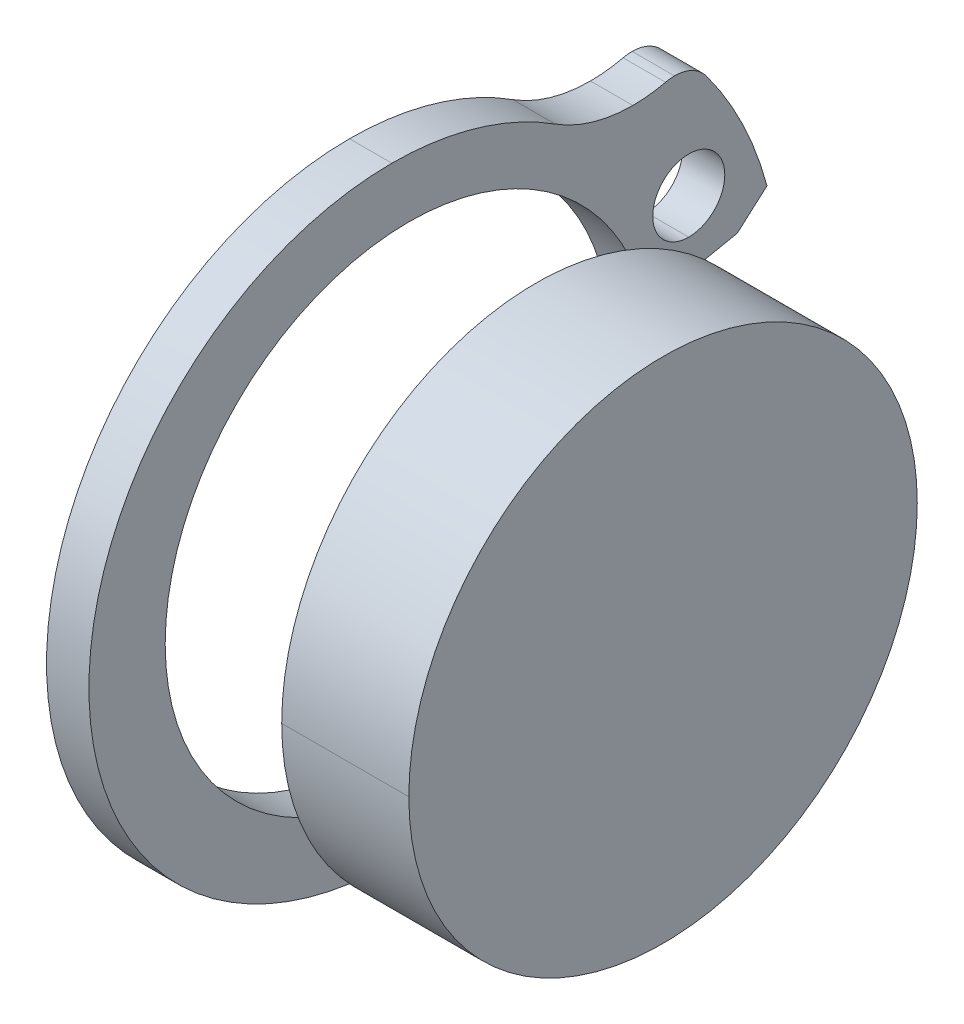
ISO-10303-21;
HEADER;
FILE_DESCRIPTION(('STEP AP214'),'2;1');
FILE_NAME('part.step','',(''),(''),'','','');
FILE_SCHEMA(('AUTOMOTIVE_DESIGN { 1 0 10303 214 1 1 1 1 }'));
ENDSEC;
DATA;
#1=APPLICATION_CONTEXT('core data for automotive mechanical design processes');
#2=APPLICATION_PROTOCOL_DEFINITION('international standard','automotive_design',2000,#1);
#3=PRODUCT_CONTEXT('',#1,'mechanical');
#4=PRODUCT('Part','Part','',(#3));
#5=PRODUCT_RELATED_PRODUCT_CATEGORY('part','',(#4));
#6=PRODUCT_DEFINITION_FORMATION('','',#4);
#7=PRODUCT_DEFINITION_CONTEXT('part definition',#1,'design');
#8=PRODUCT_DEFINITION('design','',#6,#7);
#9=PRODUCT_DEFINITION_SHAPE('','',#8);
#10=(LENGTH_UNIT() NAMED_UNIT(*) SI_UNIT(.MILLI.,.METRE.));
#11=(NAMED_UNIT(*) PLANE_ANGLE_UNIT() SI_UNIT($,.RADIAN.));
#12=(NAMED_UNIT(*) SI_UNIT($,.STERADIAN.) SOLID_ANGLE_UNIT());
#13=UNCERTAINTY_MEASURE_WITH_UNIT(LENGTH_MEASURE(1.E-05),#10,'distance_accuracy_value','');
#14=(GEOMETRIC_REPRESENTATION_CONTEXT(3) GLOBAL_UNCERTAINTY_ASSIGNED_CONTEXT((#13)) GLOBAL_UNIT_ASSIGNED_CONTEXT((#10,
#11,#12)) REPRESENTATION_CONTEXT('',''));
#15=CARTESIAN_POINT('',(0.,0.,0.));
#16=DIRECTION('',(0.,0.,1.));
#17=DIRECTION('',(1.,0.,0.));
#18=AXIS2_PLACEMENT_3D('',#15,#16,#17);
#19=CARTESIAN_POINT('',(-4.,3.03700699861608,-0.21027055578493));
#20=DIRECTION('',(-1.,0.,0.));
#21=DIRECTION('',(0.,0.,1.));
#22=AXIS2_PLACEMENT_3D('',#19,#20,#21);
#23=PLANE('',#22);
#24=CARTESIAN_POINT('',(-4.,2.985,-6.6069868321346));
#25=DIRECTION('',(1.,0.,0.));
#26=DIRECTION('',(0.,1.,0.));
#27=AXIS2_PLACEMENT_3D('',#24,#25,#26);
#28=CIRCLE('',#27,0.85);
#29=CARTESIAN_POINT('',(-4.,2.135,-6.6069868321346));
#30=VERTEX_POINT('',#29);
#31=CARTESIAN_POINT('',(-4.,3.835,-6.6069868321346));
#32=VERTEX_POINT('',#31);
#33=EDGE_CURVE('P0_E337',#30,#32,#28,.T.);
#34=ORIENTED_EDGE('',*,*,#33,.T.);
#35=CARTESIAN_POINT('',(-4.,2.985,-6.6069868321346));
#36=DIRECTION('',(1.,0.,0.));
#37=DIRECTION('',(0.,1.,0.));
#38=AXIS2_PLACEMENT_3D('',#35,#36,#37);
#39=CIRCLE('',#38,0.85);
#40=EDGE_CURVE('P0_E287',#32,#30,#39,.T.);
#41=ORIENTED_EDGE('',*,*,#40,.T.);
#42=EDGE_LOOP('',(#34,#41));
#43=FACE_BOUND('',#42,.T.);
#44=CARTESIAN_POINT('',(-4.,-2.985,-6.6069868321346));
#45=DIRECTION('',(1.,0.,0.));
#46=DIRECTION('',(0.,-1.,0.));
#47=AXIS2_PLACEMENT_3D('',#44,#45,#46);
#48=CIRCLE('',#47,0.85);
#49=CARTESIAN_POINT('',(-4.,-2.135,-6.6069868321346));
#50=VERTEX_POINT('',#49);
#51=CARTESIAN_POINT('',(-4.,-3.835,-6.6069868321346));
#52=VERTEX_POINT('',#51);
#53=EDGE_CURVE('P0_E460',#50,#52,#48,.T.);
#54=ORIENTED_EDGE('',*,*,#53,.T.);
#55=CARTESIAN_POINT('',(-4.,-2.985,-6.6069868321346));
#56=DIRECTION('',(1.,0.,0.));
#57=DIRECTION('',(0.,-1.,0.));
#58=AXIS2_PLACEMENT_3D('',#55,#56,#57);
#59=CIRCLE('',#58,0.85);
#60=EDGE_CURVE('P0_E363',#52,#50,#59,.T.);
#61=ORIENTED_EDGE('',*,*,#60,.T.);
#62=EDGE_LOOP('',(#54,#61));
#63=FACE_BOUND('',#62,.T.);
#64=CARTESIAN_POINT('',(-4.,0.,0.));
#65=DIRECTION('',(1.,0.,0.));
#66=DIRECTION('',(0.,1.,0.));
#67=AXIS2_PLACEMENT_3D('',#64,#65,#66);
#68=CIRCLE('',#67,5.75);
#69=CARTESIAN_POINT('',(-4.,1.21229602418324,-5.6207506927233));
#70=VERTEX_POINT('',#69);
#71=CARTESIAN_POINT('',(-4.,5.75,0.));
#72=VERTEX_POINT('',#71);
#73=EDGE_CURVE('P0_E393',#70,#72,#68,.T.);
#74=ORIENTED_EDGE('',*,*,#73,.T.);
#75=CARTESIAN_POINT('',(-4.,0.,0.));
#76=DIRECTION('',(1.,0.,0.));
#77=DIRECTION('',(0.,1.,0.));
#78=AXIS2_PLACEMENT_3D('',#75,#76,#77);
#79=CIRCLE('',#78,5.75);
#80=CARTESIAN_POINT('',(-4.,-5.75,0.));
#81=VERTEX_POINT('',#80);
#82=EDGE_CURVE('P0_E316',#72,#81,#79,.T.);
#83=ORIENTED_EDGE('',*,*,#82,.T.);
#84=CARTESIAN_POINT('',(-4.,0.,0.));
#85=DIRECTION('',(1.,0.,0.));
#86=DIRECTION('',(0.,1.,0.));
#87=AXIS2_PLACEMENT_3D('',#84,#85,#86);
#88=CIRCLE('',#87,5.75);
#89=CARTESIAN_POINT('',(-4.,-1.21229602418324,-5.6207506927233));
#90=VERTEX_POINT('',#89);
#91=EDGE_CURVE('P0_E310',#81,#90,#88,.T.);
#92=ORIENTED_EDGE('',*,*,#91,.T.);
#93=DIRECTION('',(0.,-0.197391304347826,-0.98032477932972));
#94=VECTOR('',#93,1.);
#95=CARTESIAN_POINT('',(-4.,0.,0.4));
#96=LINE('',#95,#94);
#97=CARTESIAN_POINT('',(-4.,-1.64102669274027,-7.75));
#98=VERTEX_POINT('',#97);
#99=EDGE_CURVE('P0_E269',#90,#98,#96,.T.);
#100=ORIENTED_EDGE('',*,*,#99,.T.);
#101=DIRECTION('',(0.,-0.661108273716222,-0.750290510684999));
#102=VECTOR('',#101,1.);
#103=CARTESIAN_POINT('',(-4.,-1.64102669274027,-7.75));
#104=LINE('',#103,#102);
#105=CARTESIAN_POINT('',(-4.,-2.26044812956455,-8.45298019952419));
#106=VERTEX_POINT('',#105);
#107=EDGE_CURVE('P0_E427',#98,#106,#104,.T.);
#108=ORIENTED_EDGE('',*,*,#107,.T.);
#109=CARTESIAN_POINT('',(-4.,0.,0.));
#110=DIRECTION('',(1.,0.,0.));
#111=DIRECTION('',(0.,-1.,0.));
#112=AXIS2_PLACEMENT_3D('',#109,#110,#111);
#113=CIRCLE('',#112,8.75);
#114=CARTESIAN_POINT('',(-4.,-5.22252319749716,-7.02052358813814));
#115=VERTEX_POINT('',#114);
#116=EDGE_CURVE('P0_E167',#115,#106,#113,.T.);
#117=ORIENTED_EDGE('',*,*,#116,.F.);
#118=CARTESIAN_POINT('',(-4.,-4.66445929010747,-6.27033049614852));
#119=DIRECTION('',(1.,0.,0.));
#120=DIRECTION('',(0.,-1.,0.));
#121=AXIS2_PLACEMENT_3D('',#118,#119,#120);
#122=CIRCLE('',#121,0.935);
#123=CARTESIAN_POINT('',(-4.,-5.59945929010747,-6.27033049614852));
#124=VERTEX_POINT('',#123);
#125=EDGE_CURVE('P0_E288',#124,#115,#122,.T.);
#126=ORIENTED_EDGE('',*,*,#125,.F.);
#127=CARTESIAN_POINT('',(-4.,-4.66445929010747,-6.27033049614852));
#128=DIRECTION('',(1.,0.,0.));
#129=DIRECTION('',(0.,-1.,0.));
#130=AXIS2_PLACEMENT_3D('',#127,#128,#129);
#131=CIRCLE('',#130,0.935);
#132=CARTESIAN_POINT('',(-4.,-5.57505883613079,-6.05811959449139));
#133=VERTEX_POINT('',#132);
#134=EDGE_CURVE('P0_E404',#133,#124,#131,.T.);
#135=ORIENTED_EDGE('',*,*,#134,.F.);
#136=CARTESIAN_POINT('',(-4.,-8.88632991257921,-5.28644358846546));
#137=DIRECTION('',(1.,0.,0.));
#138=DIRECTION('',(0.,-1.,0.));
#139=AXIS2_PLACEMENT_3D('',#136,#137,#138);
#140=CIRCLE('',#139,3.4);
#141=CARTESIAN_POINT('',(-4.,-5.48632991257921,-5.28644358846546));
#142=VERTEX_POINT('',#141);
#143=EDGE_CURVE('P0_E21',#133,#142,#140,.T.);
#144=ORIENTED_EDGE('',*,*,#143,.T.);
#145=CARTESIAN_POINT('',(-4.,-8.88632991257921,-5.28644358846546));
#146=DIRECTION('',(1.,0.,0.));
#147=DIRECTION('',(0.,-1.,0.));
#148=AXIS2_PLACEMENT_3D('',#145,#146,#147);
#149=CIRCLE('',#148,3.4);
#150=CARTESIAN_POINT('',(-4.,-6.02248899288543,-3.453845654742));
#151=VERTEX_POINT('',#150);
#152=EDGE_CURVE('P0_E294',#142,#151,#149,.T.);
#153=ORIENTED_EDGE('',*,*,#152,.T.);
#154=CARTESIAN_POINT('',(-4.,0.,0.4));
#155=DIRECTION('',(1.,0.,0.));
#156=DIRECTION('',(0.,-1.,0.));
#157=AXIS2_PLACEMENT_3D('',#154,#155,#156);
#158=CIRCLE('',#157,7.15);
#159=CARTESIAN_POINT('',(-4.,-7.15,0.4));
#160=VERTEX_POINT('',#159);
#161=EDGE_CURVE('P0_E449',#160,#151,#158,.T.);
#162=ORIENTED_EDGE('',*,*,#161,.F.);
#163=CARTESIAN_POINT('',(-4.,0.,0.4));
#164=DIRECTION('',(1.,0.,0.));
#165=DIRECTION('',(0.,-1.,0.));
#166=AXIS2_PLACEMENT_3D('',#163,#164,#165);
#167=CIRCLE('',#166,7.15);
#168=CARTESIAN_POINT('',(-4.,7.15,0.4));
#169=VERTEX_POINT('',#168);
#170=EDGE_CURVE('P0_E11',#169,#160,#167,.T.);
#171=ORIENTED_EDGE('',*,*,#170,.F.);
#172=CARTESIAN_POINT('',(-4.,0.,0.4));
#173=DIRECTION('',(1.,0.,0.));
#174=DIRECTION('',(0.,-1.,0.));
#175=AXIS2_PLACEMENT_3D('',#172,#173,#174);
#176=CIRCLE('',#175,7.15);
#177=CARTESIAN_POINT('',(-4.,6.02248899288543,-3.453845654742));
#178=VERTEX_POINT('',#177);
#179=EDGE_CURVE('P0_E348',#178,#169,#176,.T.);
#180=ORIENTED_EDGE('',*,*,#179,.F.);
#181=CARTESIAN_POINT('',(-4.,8.88632991257921,-5.28644358846546));
#182=DIRECTION('',(-1.,0.,0.));
#183=DIRECTION('',(0.,1.,0.));
#184=AXIS2_PLACEMENT_3D('',#181,#182,#183);
#185=CIRCLE('',#184,3.4);
#186=CARTESIAN_POINT('',(-4.,5.48632991257921,-5.28644358846546));
#187=VERTEX_POINT('',#186);
#188=EDGE_CURVE('P0_E347',#187,#178,#185,.T.);
#189=ORIENTED_EDGE('',*,*,#188,.F.);
#190=CARTESIAN_POINT('',(-4.,8.88632991257921,-5.28644358846546));
#191=DIRECTION('',(-1.,0.,0.));
#192=DIRECTION('',(0.,1.,0.));
#193=AXIS2_PLACEMENT_3D('',#190,#191,#192);
#194=CIRCLE('',#193,3.4);
#195=CARTESIAN_POINT('',(-4.,5.57505883613079,-6.05811959449139));
#196=VERTEX_POINT('',#195);
#197=EDGE_CURVE('P0_E28',#196,#187,#194,.T.);
#198=ORIENTED_EDGE('',*,*,#197,.F.);
#199=CARTESIAN_POINT('',(-4.,4.66445929010747,-6.27033049614852));
#200=DIRECTION('',(1.,0.,0.));
#201=DIRECTION('',(0.,1.,0.));
#202=AXIS2_PLACEMENT_3D('',#199,#200,#201);
#203=CIRCLE('',#202,0.935);
#204=CARTESIAN_POINT('',(-4.,5.59945929010747,-6.27033049614852));
#205=VERTEX_POINT('',#204);
#206=EDGE_CURVE('P0_E143',#205,#196,#203,.T.);
#207=ORIENTED_EDGE('',*,*,#206,.F.);
#208=CARTESIAN_POINT('',(-4.,4.66445929010747,-6.27033049614852));
#209=DIRECTION('',(1.,0.,0.));
#210=DIRECTION('',(0.,1.,0.));
#211=AXIS2_PLACEMENT_3D('',#208,#209,#210);
#212=CIRCLE('',#211,0.935);
#213=CARTESIAN_POINT('',(-4.,5.22252319749716,-7.02052358813814));
#214=VERTEX_POINT('',#213);
#215=EDGE_CURVE('P0_E321',#214,#205,#212,.T.);
#216=ORIENTED_EDGE('',*,*,#215,.F.);
#217=CARTESIAN_POINT('',(-4.,0.,0.));
#218=DIRECTION('',(1.,0.,0.));
#219=DIRECTION('',(0.,1.,0.));
#220=AXIS2_PLACEMENT_3D('',#217,#218,#219);
#221=CIRCLE('',#220,8.75);
#222=CARTESIAN_POINT('',(-4.,2.26044812956455,-8.45298019952419));
#223=VERTEX_POINT('',#222);
#224=EDGE_CURVE('P0_E432',#223,#214,#221,.T.);
#225=ORIENTED_EDGE('',*,*,#224,.F.);
#226=DIRECTION('',(0.,0.661108273716222,-0.750290510684999));
#227=VECTOR('',#226,1.);
#228=CARTESIAN_POINT('',(-4.,1.64102669274027,-7.75));
#229=LINE('',#228,#227);
#230=CARTESIAN_POINT('',(-4.,1.64102669274027,-7.75));
#231=VERTEX_POINT('',#230);
#232=EDGE_CURVE('P0_E255',#231,#223,#229,.T.);
#233=ORIENTED_EDGE('',*,*,#232,.F.);
#234=DIRECTION('',(0.,0.197391304347826,-0.98032477932972));
#235=VECTOR('',#234,1.);
#236=CARTESIAN_POINT('',(-4.,0.0805411873737555,0.));
#237=LINE('',#236,#235);
#238=EDGE_CURVE('P0_E251',#70,#231,#237,.T.);
#239=ORIENTED_EDGE('',*,*,#238,.F.);
#240=EDGE_LOOP('',(#74,#83,#92,#100,#108,#117,#126,#135,#144,#153,#162,#171,#180,#189,#198,#207,
#216,#225,#233,#239));
#241=FACE_BOUND('',#240,.T.);
#242=ADVANCED_FACE('P0_F17',(#43,#63,#241),#23,.T.);
#243=CARTESIAN_POINT('',(-3.,0.,0.4));
#244=DIRECTION('',(-1.,0.,0.));
#245=DIRECTION('',(0.,1.,0.));
#246=AXIS2_PLACEMENT_3D('',#243,#244,#245);
#247=CYLINDRICAL_SURFACE('',#246,7.15);
#248=DIRECTION('',(-1.,0.,0.));
#249=VECTOR('',#248,1.);
#250=CARTESIAN_POINT('',(-3.,7.15,0.4));
#251=LINE('',#250,#249);
#252=CARTESIAN_POINT('',(-3.,7.15,0.4));
#253=VERTEX_POINT('',#252);
#254=EDGE_CURVE('P0_E353',#253,#169,#251,.T.);
#255=ORIENTED_EDGE('',*,*,#254,.T.);
#256=ORIENTED_EDGE('',*,*,#170,.T.);
#257=DIRECTION('',(1.,0.,0.));
#258=VECTOR('',#257,1.);
#259=CARTESIAN_POINT('',(-3.,-7.15,0.4));
#260=LINE('',#259,#258);
#261=CARTESIAN_POINT('',(-3.,-7.15,0.4));
#262=VERTEX_POINT('',#261);
#263=EDGE_CURVE('P0_E465',#160,#262,#260,.T.);
#264=ORIENTED_EDGE('',*,*,#263,.T.);
#265=CARTESIAN_POINT('',(-3.,0.,0.4));
#266=DIRECTION('',(-1.,0.,0.));
#267=DIRECTION('',(0.,-1.,0.));
#268=AXIS2_PLACEMENT_3D('',#265,#266,#267);
#269=CIRCLE('',#268,7.15);
#270=EDGE_CURVE('P0_E330',#262,#253,#269,.T.);
#271=ORIENTED_EDGE('',*,*,#270,.T.);
#272=EDGE_LOOP('',(#255,#256,#264,#271));
#273=FACE_BOUND('',#272,.T.);
#274=ADVANCED_FACE('P0_F534',(#273),#247,.T.);
#275=CARTESIAN_POINT('',(-3.,8.88632991257921,-5.28644358846546));
#276=DIRECTION('',(-1.,0.,0.));
#277=DIRECTION('',(0.,1.,0.));
#278=AXIS2_PLACEMENT_3D('',#275,#276,#277);
#279=CYLINDRICAL_SURFACE('',#278,3.4);
#280=DIRECTION('',(1.,0.,0.));
#281=VECTOR('',#280,1.);
#282=CARTESIAN_POINT('',(-3.5,5.48632991257921,-5.28644358846546));
#283=LINE('',#282,#281);
#284=CARTESIAN_POINT('',(-3.,5.48632991257921,-5.28644358846546));
#285=VERTEX_POINT('',#284);
#286=EDGE_CURVE('P0_E343',#187,#285,#283,.T.);
#287=ORIENTED_EDGE('',*,*,#286,.T.);
#288=CARTESIAN_POINT('',(-3.,8.88632991257921,-5.28644358846546));
#289=DIRECTION('',(-1.,0.,0.));
#290=DIRECTION('',(0.,1.,0.));
#291=AXIS2_PLACEMENT_3D('',#288,#289,#290);
#292=CIRCLE('',#291,3.4);
#293=CARTESIAN_POINT('',(-3.,5.57505883613079,-6.05811959449139));
#294=VERTEX_POINT('',#293);
#295=EDGE_CURVE('P0_E327',#294,#285,#292,.T.);
#296=ORIENTED_EDGE('',*,*,#295,.F.);
#297=DIRECTION('',(-1.,0.,0.));
#298=VECTOR('',#297,1.);
#299=CARTESIAN_POINT('',(-3.,5.57505883613079,-6.05811959449139));
#300=LINE('',#299,#298);
#301=EDGE_CURVE('P0_E405',#294,#196,#300,.T.);
#302=ORIENTED_EDGE('',*,*,#301,.T.);
#303=ORIENTED_EDGE('',*,*,#197,.T.);
#304=EDGE_LOOP('',(#287,#296,#302,#303));
#305=FACE_BOUND('',#304,.T.);
#306=ADVANCED_FACE('P0_F522',(#305),#279,.F.);
#307=CARTESIAN_POINT('',(-3.,4.66445929010747,-6.27033049614852));
#308=DIRECTION('',(-1.,0.,0.));
#309=DIRECTION('',(0.,1.,0.));
#310=AXIS2_PLACEMENT_3D('',#307,#308,#309);
#311=CYLINDRICAL_SURFACE('',#310,0.935);
#312=DIRECTION('',(-1.,0.,0.));
#313=VECTOR('',#312,1.);
#314=CARTESIAN_POINT('',(-3.5,5.59945929010747,-6.27033049614852));
#315=LINE('',#314,#313);
#316=CARTESIAN_POINT('',(-3.,5.59945929010747,-6.27033049614852));
#317=VERTEX_POINT('',#316);
#318=EDGE_CURVE('P0_E358',#317,#205,#315,.T.);
#319=ORIENTED_EDGE('',*,*,#318,.T.);
#320=ORIENTED_EDGE('',*,*,#206,.T.);
#321=ORIENTED_EDGE('',*,*,#301,.F.);
#322=CARTESIAN_POINT('',(-3.,4.66445929010747,-6.27033049614852));
#323=DIRECTION('',(-1.,0.,0.));
#324=DIRECTION('',(0.,1.,0.));
#325=AXIS2_PLACEMENT_3D('',#322,#323,#324);
#326=CIRCLE('',#325,0.935);
#327=EDGE_CURVE('P0_E331',#294,#317,#326,.T.);
#328=ORIENTED_EDGE('',*,*,#327,.T.);
#329=EDGE_LOOP('',(#319,#320,#321,#328));
#330=FACE_BOUND('',#329,.T.);
#331=ADVANCED_FACE('P0_F520',(#330),#311,.T.);
#332=CARTESIAN_POINT('',(-3.,0.,0.));
#333=DIRECTION('',(-1.,0.,0.));
#334=DIRECTION('',(0.,1.,0.));
#335=AXIS2_PLACEMENT_3D('',#332,#333,#334);
#336=CYLINDRICAL_SURFACE('',#335,8.75);
#337=ORIENTED_EDGE('',*,*,#224,.T.);
#338=DIRECTION('',(-1.,0.,0.));
#339=VECTOR('',#338,1.);
#340=CARTESIAN_POINT('',(-3.,5.22252319749716,-7.02052358813814));
#341=LINE('',#340,#339);
#342=CARTESIAN_POINT('',(-3.,5.22252319749716,-7.02052358813814));
#343=VERTEX_POINT('',#342);
#344=EDGE_CURVE('P0_E317',#343,#214,#341,.T.);
#345=ORIENTED_EDGE('',*,*,#344,.F.);
#346=CARTESIAN_POINT('',(-3.,0.,0.));
#347=DIRECTION('',(-1.,0.,0.));
#348=DIRECTION('',(0.,1.,0.));
#349=AXIS2_PLACEMENT_3D('',#346,#347,#348);
#350=CIRCLE('',#349,8.75);
#351=CARTESIAN_POINT('',(-3.,2.26044812956455,-8.45298019952419));
#352=VERTEX_POINT('',#351);
#353=EDGE_CURVE('P0_E130',#343,#352,#350,.T.);
#354=ORIENTED_EDGE('',*,*,#353,.T.);
#355=DIRECTION('',(-1.,0.,0.));
#356=VECTOR('',#355,1.);
#357=CARTESIAN_POINT('',(-3.,2.26044812956455,-8.45298019952419));
#358=LINE('',#357,#356);
#359=EDGE_CURVE('P0_E260',#352,#223,#358,.T.);
#360=ORIENTED_EDGE('',*,*,#359,.T.);
#361=EDGE_LOOP('',(#337,#345,#354,#360));
#362=FACE_BOUND('',#361,.T.);
#363=ADVANCED_FACE('P0_F512',(#362),#336,.T.);
#364=CARTESIAN_POINT('',(-3.,1.64102669274027,-7.75));
#365=DIRECTION('',(0.,-0.750290510684999,-0.661108273716222));
#366=DIRECTION('',(0.,0.661108273716222,-0.750290510684999));
#367=AXIS2_PLACEMENT_3D('',#364,#365,#366);
#368=PLANE('',#367);
#369=ORIENTED_EDGE('',*,*,#232,.T.);
#370=ORIENTED_EDGE('',*,*,#359,.F.);
#371=DIRECTION('',(0.,0.661108273716222,-0.750290510684999));
#372=VECTOR('',#371,1.);
#373=CARTESIAN_POINT('',(-3.,1.64102669274027,-7.75));
#374=LINE('',#373,#372);
#375=CARTESIAN_POINT('',(-3.,1.64102669274027,-7.75));
#376=VERTEX_POINT('',#375);
#377=EDGE_CURVE('P0_E257',#376,#352,#374,.T.);
#378=ORIENTED_EDGE('',*,*,#377,.F.);
#379=DIRECTION('',(-1.,0.,0.));
#380=VECTOR('',#379,1.);
#381=CARTESIAN_POINT('',(-3.,1.64102669274027,-7.75));
#382=LINE('',#381,#380);
#383=EDGE_CURVE('P0_E244',#376,#231,#382,.T.);
#384=ORIENTED_EDGE('',*,*,#383,.T.);
#385=EDGE_LOOP('',(#369,#370,#378,#384));
#386=FACE_BOUND('',#385,.T.);
#387=ADVANCED_FACE('P0_F258',(#386),#368,.T.);
#388=CARTESIAN_POINT('',(-3.,0.0805411873737555,0.));
#389=DIRECTION('',(0.,-0.98032477932972,-0.197391304347826));
#390=DIRECTION('',(0.,0.197391304347826,-0.98032477932972));
#391=AXIS2_PLACEMENT_3D('',#388,#389,#390);
#392=PLANE('',#391);
#393=DIRECTION('',(-1.,0.,0.));
#394=VECTOR('',#393,1.);
#395=CARTESIAN_POINT('',(-3.5,1.21229602418324,-5.6207506927233));
#396=LINE('',#395,#394);
#397=CARTESIAN_POINT('',(-3.,1.21229602418324,-5.6207506927233));
#398=VERTEX_POINT('',#397);
#399=EDGE_CURVE('P0_E390',#398,#70,#396,.T.);
#400=ORIENTED_EDGE('',*,*,#399,.T.);
#401=ORIENTED_EDGE('',*,*,#238,.T.);
#402=ORIENTED_EDGE('',*,*,#383,.F.);
#403=DIRECTION('',(0.,0.197391304347826,-0.98032477932972));
#404=VECTOR('',#403,1.);
#405=CARTESIAN_POINT('',(-3.,0.,0.4));
#406=LINE('',#405,#404);
#407=EDGE_CURVE('P0_E249',#398,#376,#406,.T.);
#408=ORIENTED_EDGE('',*,*,#407,.F.);
#409=EDGE_LOOP('',(#400,#401,#402,#408));
#410=FACE_BOUND('',#409,.T.);
#411=ADVANCED_FACE('P0_F247',(#410),#392,.T.);
#412=CARTESIAN_POINT('',(-3.5,2.985,-6.6069868321346));
#413=DIRECTION('',(-1.,0.,0.));
#414=DIRECTION('',(0.,1.,0.));
#415=AXIS2_PLACEMENT_3D('',#412,#413,#414);
#416=CYLINDRICAL_SURFACE('',#415,0.85);
#417=DIRECTION('',(1.,0.,0.));
#418=VECTOR('',#417,1.);
#419=CARTESIAN_POINT('',(-3.5,3.835,-6.6069868321346));
#420=LINE('',#419,#418);
#421=CARTESIAN_POINT('',(-3.,3.835,-6.6069868321346));
#422=VERTEX_POINT('',#421);
#423=EDGE_CURVE('P0_E342',#32,#422,#420,.T.);
#424=ORIENTED_EDGE('',*,*,#423,.T.);
#425=CARTESIAN_POINT('',(-3.,2.985,-6.6069868321346));
#426=DIRECTION('',(-1.,0.,0.));
#427=DIRECTION('',(0.,1.,0.));
#428=AXIS2_PLACEMENT_3D('',#425,#426,#427);
#429=CIRCLE('',#428,0.85);
#430=CARTESIAN_POINT('',(-3.,2.135,-6.6069868321346));
#431=VERTEX_POINT('',#430);
#432=EDGE_CURVE('P0_E301',#431,#422,#429,.T.);
#433=ORIENTED_EDGE('',*,*,#432,.F.);
#434=DIRECTION('',(-1.,0.,0.));
#435=VECTOR('',#434,1.);
#436=CARTESIAN_POINT('',(-3.5,2.135,-6.6069868321346));
#437=LINE('',#436,#435);
#438=EDGE_CURVE('P0_E341',#431,#30,#437,.T.);
#439=ORIENTED_EDGE('',*,*,#438,.T.);
#440=ORIENTED_EDGE('',*,*,#40,.F.);
#441=EDGE_LOOP('',(#424,#433,#439,#440));
#442=FACE_BOUND('',#441,.T.);
#443=ADVANCED_FACE('P0_F1086',(#442),#416,.F.);
#444=CARTESIAN_POINT('',(-4.,-8.88632991257921,-5.28644358846546));
#445=DIRECTION('',(1.,0.,0.));
#446=DIRECTION('',(0.,-1.,0.));
#447=AXIS2_PLACEMENT_3D('',#444,#445,#446);
#448=CYLINDRICAL_SURFACE('',#447,3.4);
#449=DIRECTION('',(-1.,0.,0.));
#450=VECTOR('',#449,1.);
#451=CARTESIAN_POINT('',(-3.5,-5.48632991257921,-5.28644358846546));
#452=LINE('',#451,#450);
#453=CARTESIAN_POINT('',(-3.,-5.48632991257921,-5.28644358846546));
#454=VERTEX_POINT('',#453);
#455=EDGE_CURVE('P0_E323',#454,#142,#452,.T.);
#456=ORIENTED_EDGE('',*,*,#455,.T.);
#457=ORIENTED_EDGE('',*,*,#143,.F.);
#458=DIRECTION('',(1.,0.,0.));
#459=VECTOR('',#458,1.);
#460=CARTESIAN_POINT('',(-4.,-5.57505883613079,-6.05811959449139));
#461=LINE('',#460,#459);
#462=CARTESIAN_POINT('',(-3.,-5.57505883613079,-6.05811959449139));
#463=VERTEX_POINT('',#462);
#464=EDGE_CURVE('P0_E401',#133,#463,#461,.T.);
#465=ORIENTED_EDGE('',*,*,#464,.T.);
#466=CARTESIAN_POINT('',(-3.,-8.88632991257921,-5.28644358846546));
#467=DIRECTION('',(1.,0.,0.));
#468=DIRECTION('',(0.,-1.,0.));
#469=AXIS2_PLACEMENT_3D('',#466,#467,#468);
#470=CIRCLE('',#469,3.4);
#471=EDGE_CURVE('P0_E366',#463,#454,#470,.T.);
#472=ORIENTED_EDGE('',*,*,#471,.T.);
#473=EDGE_LOOP('',(#456,#457,#465,#472));
#474=FACE_BOUND('',#473,.T.);
#475=ADVANCED_FACE('P0_F546',(#474),#448,.F.);
#476=CARTESIAN_POINT('',(-4.,-4.66445929010747,-6.27033049614852));
#477=DIRECTION('',(1.,0.,0.));
#478=DIRECTION('',(0.,-1.,0.));
#479=AXIS2_PLACEMENT_3D('',#476,#477,#478);
#480=CYLINDRICAL_SURFACE('',#479,0.935);
#481=DIRECTION('',(1.,0.,0.));
#482=VECTOR('',#481,1.);
#483=CARTESIAN_POINT('',(-3.5,-5.59945929010747,-6.27033049614852));
#484=LINE('',#483,#482);
#485=CARTESIAN_POINT('',(-3.,-5.59945929010747,-6.27033049614852));
#486=VERTEX_POINT('',#485);
#487=EDGE_CURVE('P0_E293',#124,#486,#484,.T.);
#488=ORIENTED_EDGE('',*,*,#487,.T.);
#489=CARTESIAN_POINT('',(-3.,-4.66445929010747,-6.27033049614852));
#490=DIRECTION('',(-1.,0.,0.));
#491=DIRECTION('',(0.,-1.,0.));
#492=AXIS2_PLACEMENT_3D('',#489,#490,#491);
#493=CIRCLE('',#492,0.935);
#494=EDGE_CURVE('P0_E389',#486,#463,#493,.T.);
#495=ORIENTED_EDGE('',*,*,#494,.T.);
#496=ORIENTED_EDGE('',*,*,#464,.F.);
#497=ORIENTED_EDGE('',*,*,#134,.T.);
#498=EDGE_LOOP('',(#488,#495,#496,#497));
#499=FACE_BOUND('',#498,.T.);
#500=ADVANCED_FACE('P0_F549',(#499),#480,.T.);
#501=CARTESIAN_POINT('',(-4.,0.,0.));
#502=DIRECTION('',(1.,0.,0.));
#503=DIRECTION('',(0.,-1.,0.));
#504=AXIS2_PLACEMENT_3D('',#501,#502,#503);
#505=CYLINDRICAL_SURFACE('',#504,8.75);
#506=CARTESIAN_POINT('',(-3.,0.,0.));
#507=DIRECTION('',(-1.,0.,0.));
#508=DIRECTION('',(0.,-1.,0.));
#509=AXIS2_PLACEMENT_3D('',#506,#507,#508);
#510=CIRCLE('',#509,8.75);
#511=CARTESIAN_POINT('',(-3.,-2.26044812956455,-8.45298019952419));
#512=VERTEX_POINT('',#511);
#513=CARTESIAN_POINT('',(-3.,-5.22252319749716,-7.02052358813814));
#514=VERTEX_POINT('',#513);
#515=EDGE_CURVE('P0_E373',#512,#514,#510,.T.);
#516=ORIENTED_EDGE('',*,*,#515,.T.);
#517=DIRECTION('',(1.,0.,0.));
#518=VECTOR('',#517,1.);
#519=CARTESIAN_POINT('',(-4.,-5.22252319749716,-7.02052358813814));
#520=LINE('',#519,#518);
#521=EDGE_CURVE('P0_E292',#115,#514,#520,.T.);
#522=ORIENTED_EDGE('',*,*,#521,.F.);
#523=ORIENTED_EDGE('',*,*,#116,.T.);
#524=DIRECTION('',(1.,0.,0.));
#525=VECTOR('',#524,1.);
#526=CARTESIAN_POINT('',(-4.,-2.26044812956455,-8.45298019952419));
#527=LINE('',#526,#525);
#528=EDGE_CURVE('P0_E429',#106,#512,#527,.T.);
#529=ORIENTED_EDGE('',*,*,#528,.T.);
#530=EDGE_LOOP('',(#516,#522,#523,#529));
#531=FACE_BOUND('',#530,.T.);
#532=ADVANCED_FACE('P0_F556',(#531),#505,.T.);
#533=CARTESIAN_POINT('',(-4.,-1.64102669274027,-7.75));
#534=DIRECTION('',(0.,0.750290510684999,-0.661108273716222));
#535=DIRECTION('',(-1.,0.,0.));
#536=AXIS2_PLACEMENT_3D('',#533,#534,#535);
#537=PLANE('',#536);
#538=DIRECTION('',(0.,-0.661108273716222,-0.750290510684999));
#539=VECTOR('',#538,1.);
#540=CARTESIAN_POINT('',(-3.,-1.64102669274027,-7.75));
#541=LINE('',#540,#539);
#542=CARTESIAN_POINT('',(-3.,-1.64102669274027,-7.75));
#543=VERTEX_POINT('',#542);
#544=EDGE_CURVE('P0_E305',#543,#512,#541,.T.);
#545=ORIENTED_EDGE('',*,*,#544,.T.);
#546=ORIENTED_EDGE('',*,*,#528,.F.);
#547=ORIENTED_EDGE('',*,*,#107,.F.);
#548=DIRECTION('',(1.,0.,0.));
#549=VECTOR('',#548,1.);
#550=CARTESIAN_POINT('',(-4.,-1.64102669274027,-7.75));
#551=LINE('',#550,#549);
#552=EDGE_CURVE('P0_E277',#98,#543,#551,.T.);
#553=ORIENTED_EDGE('',*,*,#552,.T.);
#554=EDGE_LOOP('',(#545,#546,#547,#553));
#555=FACE_BOUND('',#554,.T.);
#556=ADVANCED_FACE('P0_F561',(#555),#537,.T.);
#557=CARTESIAN_POINT('',(-3.5,-2.985,-6.6069868321346));
#558=DIRECTION('',(1.,0.,0.));
#559=DIRECTION('',(0.,-1.,0.));
#560=AXIS2_PLACEMENT_3D('',#557,#558,#559);
#561=CYLINDRICAL_SURFACE('',#560,0.85);
#562=DIRECTION('',(-1.,0.,0.));
#563=VECTOR('',#562,1.);
#564=CARTESIAN_POINT('',(-3.5,-3.835,-6.6069868321346));
#565=LINE('',#564,#563);
#566=CARTESIAN_POINT('',(-3.,-3.835,-6.6069868321346));
#567=VERTEX_POINT('',#566);
#568=EDGE_CURVE('P0_E280',#567,#52,#565,.T.);
#569=ORIENTED_EDGE('',*,*,#568,.T.);
#570=ORIENTED_EDGE('',*,*,#53,.F.);
#571=DIRECTION('',(1.,0.,0.));
#572=VECTOR('',#571,1.);
#573=CARTESIAN_POINT('',(-3.5,-2.135,-6.6069868321346));
#574=LINE('',#573,#572);
#575=CARTESIAN_POINT('',(-3.,-2.135,-6.6069868321346));
#576=VERTEX_POINT('',#575);
#577=EDGE_CURVE('P0_E474',#50,#576,#574,.T.);
#578=ORIENTED_EDGE('',*,*,#577,.T.);
#579=CARTESIAN_POINT('',(-3.,-2.985,-6.6069868321346));
#580=DIRECTION('',(-1.,0.,0.));
#581=DIRECTION('',(0.,-1.,0.));
#582=AXIS2_PLACEMENT_3D('',#579,#580,#581);
#583=CIRCLE('',#582,0.85);
#584=EDGE_CURVE('P0_E304',#567,#576,#583,.T.);
#585=ORIENTED_EDGE('',*,*,#584,.F.);
#586=EDGE_LOOP('',(#569,#570,#578,#585));
#587=FACE_BOUND('',#586,.T.);
#588=ADVANCED_FACE('P0_F1126',(#587),#561,.F.);
#589=CARTESIAN_POINT('',(-3.,3.03700699861608,-0.21027055578493));
#590=DIRECTION('',(-1.,0.,0.));
#591=DIRECTION('',(0.,0.,1.));
#592=AXIS2_PLACEMENT_3D('',#589,#590,#591);
#593=PLANE('',#592);
#594=CARTESIAN_POINT('',(-3.,-2.985,-6.6069868321346));
#595=DIRECTION('',(-1.,0.,0.));
#596=DIRECTION('',(0.,-1.,0.));
#597=AXIS2_PLACEMENT_3D('',#594,#595,#596);
#598=CIRCLE('',#597,0.85);
#599=EDGE_CURVE('P0_E283',#576,#567,#598,.T.);
#600=ORIENTED_EDGE('',*,*,#599,.T.);
#601=ORIENTED_EDGE('',*,*,#584,.T.);
#602=EDGE_LOOP('',(#600,#601));
#603=FACE_BOUND('',#602,.T.);
#604=ORIENTED_EDGE('',*,*,#432,.T.);
#605=CARTESIAN_POINT('',(-3.,2.985,-6.6069868321346));
#606=DIRECTION('',(-1.,0.,0.));
#607=DIRECTION('',(0.,1.,0.));
#608=AXIS2_PLACEMENT_3D('',#605,#606,#607);
#609=CIRCLE('',#608,0.85);
#610=EDGE_CURVE('P0_E326',#422,#431,#609,.T.);
#611=ORIENTED_EDGE('',*,*,#610,.T.);
#612=EDGE_LOOP('',(#604,#611));
#613=FACE_BOUND('',#612,.T.);
#614=CARTESIAN_POINT('',(-3.,0.,0.));
#615=DIRECTION('',(-1.,0.,0.));
#616=DIRECTION('',(0.,1.,0.));
#617=AXIS2_PLACEMENT_3D('',#614,#615,#616);
#618=CIRCLE('',#617,5.75);
#619=CARTESIAN_POINT('',(-3.,-1.21229602418324,-5.6207506927233));
#620=VERTEX_POINT('',#619);
#621=CARTESIAN_POINT('',(-3.,-5.75,0.));
#622=VERTEX_POINT('',#621);
#623=EDGE_CURVE('P0_E311',#620,#622,#618,.T.);
#624=ORIENTED_EDGE('',*,*,#623,.T.);
#625=CARTESIAN_POINT('',(-3.,0.,0.));
#626=DIRECTION('',(-1.,0.,0.));
#627=DIRECTION('',(0.,1.,0.));
#628=AXIS2_PLACEMENT_3D('',#625,#626,#627);
#629=CIRCLE('',#628,5.75);
#630=CARTESIAN_POINT('',(-3.,5.75,0.));
#631=VERTEX_POINT('',#630);
#632=EDGE_CURVE('P0_E374',#622,#631,#629,.T.);
#633=ORIENTED_EDGE('',*,*,#632,.T.);
#634=CARTESIAN_POINT('',(-3.,0.,0.));
#635=DIRECTION('',(-1.,0.,0.));
#636=DIRECTION('',(0.,1.,0.));
#637=AXIS2_PLACEMENT_3D('',#634,#635,#636);
#638=CIRCLE('',#637,5.75);
#639=EDGE_CURVE('P0_E266',#631,#398,#638,.T.);
#640=ORIENTED_EDGE('',*,*,#639,.T.);
#641=ORIENTED_EDGE('',*,*,#407,.T.);
#642=ORIENTED_EDGE('',*,*,#377,.T.);
#643=ORIENTED_EDGE('',*,*,#353,.F.);
#644=CARTESIAN_POINT('',(-3.,4.66445929010747,-6.27033049614852));
#645=DIRECTION('',(-1.,0.,0.));
#646=DIRECTION('',(0.,1.,0.));
#647=AXIS2_PLACEMENT_3D('',#644,#645,#646);
#648=CIRCLE('',#647,0.935);
#649=EDGE_CURVE('P0_E322',#317,#343,#648,.T.);
#650=ORIENTED_EDGE('',*,*,#649,.F.);
#651=ORIENTED_EDGE('',*,*,#327,.F.);
#652=ORIENTED_EDGE('',*,*,#295,.T.);
#653=CARTESIAN_POINT('',(-3.,8.88632991257921,-5.28644358846546));
#654=DIRECTION('',(-1.,0.,0.));
#655=DIRECTION('',(0.,1.,0.));
#656=AXIS2_PLACEMENT_3D('',#653,#654,#655);
#657=CIRCLE('',#656,3.4);
#658=CARTESIAN_POINT('',(-3.,6.02248899288543,-3.453845654742));
#659=VERTEX_POINT('',#658);
#660=EDGE_CURVE('P0_E411',#285,#659,#657,.T.);
#661=ORIENTED_EDGE('',*,*,#660,.T.);
#662=CARTESIAN_POINT('',(-3.,0.,0.4));
#663=DIRECTION('',(-1.,0.,0.));
#664=DIRECTION('',(0.,-1.,0.));
#665=AXIS2_PLACEMENT_3D('',#662,#663,#664);
#666=CIRCLE('',#665,7.15);
#667=EDGE_CURVE('P0_E382',#253,#659,#666,.T.);
#668=ORIENTED_EDGE('',*,*,#667,.F.);
#669=ORIENTED_EDGE('',*,*,#270,.F.);
#670=CARTESIAN_POINT('',(-3.,0.,0.4));
#671=DIRECTION('',(-1.,0.,0.));
#672=DIRECTION('',(0.,-1.,0.));
#673=AXIS2_PLACEMENT_3D('',#670,#671,#672);
#674=CIRCLE('',#673,7.15);
#675=CARTESIAN_POINT('',(-3.,-6.02248899288543,-3.453845654742));
#676=VERTEX_POINT('',#675);
#677=EDGE_CURVE('P0_E349',#676,#262,#674,.T.);
#678=ORIENTED_EDGE('',*,*,#677,.F.);
#679=CARTESIAN_POINT('',(-3.,-8.88632991257921,-5.28644358846546));
#680=DIRECTION('',(1.,0.,0.));
#681=DIRECTION('',(0.,-1.,0.));
#682=AXIS2_PLACEMENT_3D('',#679,#680,#681);
#683=CIRCLE('',#682,3.4);
#684=EDGE_CURVE('P0_E297',#454,#676,#683,.T.);
#685=ORIENTED_EDGE('',*,*,#684,.F.);
#686=ORIENTED_EDGE('',*,*,#471,.F.);
#687=ORIENTED_EDGE('',*,*,#494,.F.);
#688=CARTESIAN_POINT('',(-3.,-4.66445929010747,-6.27033049614852));
#689=DIRECTION('',(-1.,0.,0.));
#690=DIRECTION('',(0.,-1.,0.));
#691=AXIS2_PLACEMENT_3D('',#688,#689,#690);
#692=CIRCLE('',#691,0.935);
#693=EDGE_CURVE('P0_E284',#514,#486,#692,.T.);
#694=ORIENTED_EDGE('',*,*,#693,.F.);
#695=ORIENTED_EDGE('',*,*,#515,.F.);
#696=ORIENTED_EDGE('',*,*,#544,.F.);
#697=DIRECTION('',(0.,-0.197391304347826,-0.98032477932972));
#698=VECTOR('',#697,1.);
#699=CARTESIAN_POINT('',(-3.,-0.0805411873737554,0.));
#700=LINE('',#699,#698);
#701=EDGE_CURVE('P0_E312',#620,#543,#700,.T.);
#702=ORIENTED_EDGE('',*,*,#701,.F.);
#703=EDGE_LOOP('',(#624,#633,#640,#641,#642,#643,#650,#651,#652,#661,#668,#669,#678,#685,#686,
#687,#694,#695,#696,#702));
#704=FACE_BOUND('',#703,.T.);
#705=ADVANCED_FACE('P0_F264',(#603,#613,#704),#593,.F.);
#706=CARTESIAN_POINT('',(-4.,-0.0805411873737555,0.));
#707=DIRECTION('',(0.,0.98032477932972,-0.197391304347826));
#708=DIRECTION('',(-1.,0.,0.));
#709=AXIS2_PLACEMENT_3D('',#706,#707,#708);
#710=PLANE('',#709);
#711=DIRECTION('',(1.,0.,0.));
#712=VECTOR('',#711,1.);
#713=CARTESIAN_POINT('',(-3.5,-1.21229602418324,-5.6207506927233));
#714=LINE('',#713,#712);
#715=EDGE_CURVE('P0_E306',#90,#620,#714,.T.);
#716=ORIENTED_EDGE('',*,*,#715,.T.);
#717=ORIENTED_EDGE('',*,*,#701,.T.);
#718=ORIENTED_EDGE('',*,*,#552,.F.);
#719=ORIENTED_EDGE('',*,*,#99,.F.);
#720=EDGE_LOOP('',(#716,#717,#718,#719));
#721=FACE_BOUND('',#720,.T.);
#722=ADVANCED_FACE('P0_F563',(#721),#710,.T.);
#723=CARTESIAN_POINT('',(-3.5,0.,0.));
#724=DIRECTION('',(-1.,0.,0.));
#725=DIRECTION('',(0.,1.,0.));
#726=AXIS2_PLACEMENT_3D('',#723,#724,#725);
#727=CYLINDRICAL_SURFACE('',#726,5.75);
#728=DIRECTION('',(1.,0.,0.));
#729=VECTOR('',#728,1.);
#730=CARTESIAN_POINT('',(-3.5,5.75,0.));
#731=LINE('',#730,#729);
#732=EDGE_CURVE('P0_E397',#72,#631,#731,.T.);
#733=ORIENTED_EDGE('',*,*,#732,.T.);
#734=ORIENTED_EDGE('',*,*,#632,.F.);
#735=DIRECTION('',(-1.,0.,0.));
#736=VECTOR('',#735,1.);
#737=CARTESIAN_POINT('',(-3.5,-5.75,0.));
#738=LINE('',#737,#736);
#739=EDGE_CURVE('P0_E359',#622,#81,#738,.T.);
#740=ORIENTED_EDGE('',*,*,#739,.T.);
#741=ORIENTED_EDGE('',*,*,#82,.F.);
#742=EDGE_LOOP('',(#733,#734,#740,#741));
#743=FACE_BOUND('',#742,.T.);
#744=ADVANCED_FACE('P0_F506',(#743),#727,.F.);
#745=CARTESIAN_POINT('',(-3.5,0.,0.));
#746=DIRECTION('',(-1.,0.,0.));
#747=DIRECTION('',(0.,1.,0.));
#748=AXIS2_PLACEMENT_3D('',#745,#746,#747);
#749=CYLINDRICAL_SURFACE('',#748,5.75);
#750=ORIENTED_EDGE('',*,*,#732,.F.);
#751=ORIENTED_EDGE('',*,*,#73,.F.);
#752=ORIENTED_EDGE('',*,*,#399,.F.);
#753=ORIENTED_EDGE('',*,*,#639,.F.);
#754=EDGE_LOOP('',(#750,#751,#752,#753));
#755=FACE_BOUND('',#754,.T.);
#756=ADVANCED_FACE('P0_F509',(#755),#749,.F.);
#757=CARTESIAN_POINT('',(-3.5,0.,0.));
#758=DIRECTION('',(-1.,0.,0.));
#759=DIRECTION('',(0.,1.,0.));
#760=AXIS2_PLACEMENT_3D('',#757,#758,#759);
#761=CYLINDRICAL_SURFACE('',#760,5.75);
#762=ORIENTED_EDGE('',*,*,#739,.F.);
#763=ORIENTED_EDGE('',*,*,#623,.F.);
#764=ORIENTED_EDGE('',*,*,#715,.F.);
#765=ORIENTED_EDGE('',*,*,#91,.F.);
#766=EDGE_LOOP('',(#762,#763,#764,#765));
#767=FACE_BOUND('',#766,.T.);
#768=ADVANCED_FACE('P0_F568',(#767),#761,.F.);
#769=CARTESIAN_POINT('',(-3.5,-2.985,-6.6069868321346));
#770=DIRECTION('',(1.,0.,0.));
#771=DIRECTION('',(0.,-1.,0.));
#772=AXIS2_PLACEMENT_3D('',#769,#770,#771);
#773=CYLINDRICAL_SURFACE('',#772,0.85);
#774=ORIENTED_EDGE('',*,*,#568,.F.);
#775=ORIENTED_EDGE('',*,*,#599,.F.);
#776=ORIENTED_EDGE('',*,*,#577,.F.);
#777=ORIENTED_EDGE('',*,*,#60,.F.);
#778=EDGE_LOOP('',(#774,#775,#776,#777));
#779=FACE_BOUND('',#778,.T.);
#780=ADVANCED_FACE('P0_F19',(#779),#773,.F.);
#781=CARTESIAN_POINT('',(-4.,-4.66445929010747,-6.27033049614852));
#782=DIRECTION('',(1.,0.,0.));
#783=DIRECTION('',(0.,-1.,0.));
#784=AXIS2_PLACEMENT_3D('',#781,#782,#783);
#785=CYLINDRICAL_SURFACE('',#784,0.935);
#786=ORIENTED_EDGE('',*,*,#487,.F.);
#787=ORIENTED_EDGE('',*,*,#125,.T.);
#788=ORIENTED_EDGE('',*,*,#521,.T.);
#789=ORIENTED_EDGE('',*,*,#693,.T.);
#790=EDGE_LOOP('',(#786,#787,#788,#789));
#791=FACE_BOUND('',#790,.T.);
#792=ADVANCED_FACE('P0_F554',(#791),#785,.T.);
#793=CARTESIAN_POINT('',(-4.,-8.88632991257921,-5.28644358846546));
#794=DIRECTION('',(1.,0.,0.));
#795=DIRECTION('',(0.,-1.,0.));
#796=AXIS2_PLACEMENT_3D('',#793,#794,#795);
#797=CYLINDRICAL_SURFACE('',#796,3.4);
#798=ORIENTED_EDGE('',*,*,#455,.F.);
#799=ORIENTED_EDGE('',*,*,#684,.T.);
#800=DIRECTION('',(1.,0.,0.));
#801=VECTOR('',#800,1.);
#802=CARTESIAN_POINT('',(-4.,-6.02248899288543,-3.453845654742));
#803=LINE('',#802,#801);
#804=EDGE_CURVE('P0_E354',#151,#676,#803,.T.);
#805=ORIENTED_EDGE('',*,*,#804,.F.);
#806=ORIENTED_EDGE('',*,*,#152,.F.);
#807=EDGE_LOOP('',(#798,#799,#805,#806));
#808=FACE_BOUND('',#807,.T.);
#809=ADVANCED_FACE('P0_F545',(#808),#797,.F.);
#810=CARTESIAN_POINT('',(-3.5,2.985,-6.6069868321346));
#811=DIRECTION('',(-1.,0.,0.));
#812=DIRECTION('',(0.,1.,0.));
#813=AXIS2_PLACEMENT_3D('',#810,#811,#812);
#814=CYLINDRICAL_SURFACE('',#813,0.85);
#815=ORIENTED_EDGE('',*,*,#423,.F.);
#816=ORIENTED_EDGE('',*,*,#33,.F.);
#817=ORIENTED_EDGE('',*,*,#438,.F.);
#818=ORIENTED_EDGE('',*,*,#610,.F.);
#819=EDGE_LOOP('',(#815,#816,#817,#818));
#820=FACE_BOUND('',#819,.T.);
#821=ADVANCED_FACE('P0_F1177',(#820),#814,.F.);
#822=CARTESIAN_POINT('',(-3.,4.66445929010747,-6.27033049614852));
#823=DIRECTION('',(-1.,0.,0.));
#824=DIRECTION('',(0.,1.,0.));
#825=AXIS2_PLACEMENT_3D('',#822,#823,#824);
#826=CYLINDRICAL_SURFACE('',#825,0.935);
#827=ORIENTED_EDGE('',*,*,#318,.F.);
#828=ORIENTED_EDGE('',*,*,#649,.T.);
#829=ORIENTED_EDGE('',*,*,#344,.T.);
#830=ORIENTED_EDGE('',*,*,#215,.T.);
#831=EDGE_LOOP('',(#827,#828,#829,#830));
#832=FACE_BOUND('',#831,.T.);
#833=ADVANCED_FACE('P0_F515',(#832),#826,.T.);
#834=CARTESIAN_POINT('',(-3.,8.88632991257921,-5.28644358846546));
#835=DIRECTION('',(-1.,0.,0.));
#836=DIRECTION('',(0.,1.,0.));
#837=AXIS2_PLACEMENT_3D('',#834,#835,#836);
#838=CYLINDRICAL_SURFACE('',#837,3.4);
#839=ORIENTED_EDGE('',*,*,#286,.F.);
#840=ORIENTED_EDGE('',*,*,#188,.T.);
#841=DIRECTION('',(-1.,0.,0.));
#842=VECTOR('',#841,1.);
#843=CARTESIAN_POINT('',(-3.,6.02248899288543,-3.453845654742));
#844=LINE('',#843,#842);
#845=EDGE_CURVE('P0_E386',#659,#178,#844,.T.);
#846=ORIENTED_EDGE('',*,*,#845,.F.);
#847=ORIENTED_EDGE('',*,*,#660,.F.);
#848=EDGE_LOOP('',(#839,#840,#846,#847));
#849=FACE_BOUND('',#848,.T.);
#850=ADVANCED_FACE('P0_F525',(#849),#838,.F.);
#851=CARTESIAN_POINT('',(-3.,0.,0.4));
#852=DIRECTION('',(-1.,0.,0.));
#853=DIRECTION('',(0.,1.,0.));
#854=AXIS2_PLACEMENT_3D('',#851,#852,#853);
#855=CYLINDRICAL_SURFACE('',#854,7.15);
#856=ORIENTED_EDGE('',*,*,#254,.F.);
#857=ORIENTED_EDGE('',*,*,#667,.T.);
#858=ORIENTED_EDGE('',*,*,#845,.T.);
#859=ORIENTED_EDGE('',*,*,#179,.T.);
#860=EDGE_LOOP('',(#856,#857,#858,#859));
#861=FACE_BOUND('',#860,.T.);
#862=ADVANCED_FACE('P0_F532',(#861),#855,.T.);
#863=CARTESIAN_POINT('',(-3.,0.,0.4));
#864=DIRECTION('',(-1.,0.,0.));
#865=DIRECTION('',(0.,1.,0.));
#866=AXIS2_PLACEMENT_3D('',#863,#864,#865);
#867=CYLINDRICAL_SURFACE('',#866,7.15);
#868=ORIENTED_EDGE('',*,*,#263,.F.);
#869=ORIENTED_EDGE('',*,*,#161,.T.);
#870=ORIENTED_EDGE('',*,*,#804,.T.);
#871=ORIENTED_EDGE('',*,*,#677,.T.);
#872=EDGE_LOOP('',(#868,#869,#870,#871));
#873=FACE_BOUND('',#872,.T.);
#874=ADVANCED_FACE('P0_F538',(#873),#867,.T.);
#875=CLOSED_SHELL('',(#242,#274,#306,#331,#363,#387,#411,#443,#475,#500,#532,#556,#588,#705,
#722,#744,#756,#768,#780,#792,#809,#821,#833,#850,#862,#874));
#876=MANIFOLD_SOLID_BREP('P0_B1',#875);
#877=CARTESIAN_POINT('',(0.,0.,3.));
#878=DIRECTION('',(-1.,0.,0.));
#879=DIRECTION('',(0.,0.,1.));
#880=AXIS2_PLACEMENT_3D('',#877,#878,#879);
#881=PLANE('',#880);
#882=CARTESIAN_POINT('',(0.,0.,0.));
#883=DIRECTION('',(1.,0.,0.));
#884=DIRECTION('',(0.,0.,1.));
#885=AXIS2_PLACEMENT_3D('',#882,#883,#884);
#886=CIRCLE('',#885,6.);
#887=CARTESIAN_POINT('',(0.,0.,6.));
#888=VERTEX_POINT('',#887);
#889=CARTESIAN_POINT('',(0.,0.,-6.));
#890=VERTEX_POINT('',#889);
#891=EDGE_CURVE('P1_E54',#888,#890,#886,.T.);
#892=ORIENTED_EDGE('',*,*,#891,.F.);
#893=CARTESIAN_POINT('',(0.,0.,0.));
#894=DIRECTION('',(1.,0.,0.));
#895=DIRECTION('',(0.,0.,1.));
#896=AXIS2_PLACEMENT_3D('',#893,#894,#895);
#897=CIRCLE('',#896,6.);
#898=EDGE_CURVE('P1_E11',#890,#888,#897,.T.);
#899=ORIENTED_EDGE('',*,*,#898,.F.);
#900=EDGE_LOOP('',(#892,#899));
#901=FACE_BOUND('',#900,.T.);
#902=ADVANCED_FACE('P1_F17',(#901),#881,.T.);
#903=CARTESIAN_POINT('',(3.,0.,3.));
#904=DIRECTION('',(1.,0.,0.));
#905=DIRECTION('',(0.,1.,0.));
#906=AXIS2_PLACEMENT_3D('',#903,#904,#905);
#907=PLANE('',#906);
#908=CARTESIAN_POINT('',(3.,0.,0.));
#909=DIRECTION('',(1.,0.,0.));
#910=DIRECTION('',(0.,0.,1.));
#911=AXIS2_PLACEMENT_3D('',#908,#909,#910);
#912=CIRCLE('',#911,6.);
#913=CARTESIAN_POINT('',(3.,0.,6.));
#914=VERTEX_POINT('',#913);
#915=CARTESIAN_POINT('',(3.,0.,-6.));
#916=VERTEX_POINT('',#915);
#917=EDGE_CURVE('P1_E60',#914,#916,#912,.T.);
#918=ORIENTED_EDGE('',*,*,#917,.T.);
#919=CARTESIAN_POINT('',(3.,0.,0.));
#920=DIRECTION('',(1.,0.,0.));
#921=DIRECTION('',(0.,0.,1.));
#922=AXIS2_PLACEMENT_3D('',#919,#920,#921);
#923=CIRCLE('',#922,6.);
#924=EDGE_CURVE('P1_E26',#916,#914,#923,.T.);
#925=ORIENTED_EDGE('',*,*,#924,.T.);
#926=EDGE_LOOP('',(#918,#925));
#927=FACE_BOUND('',#926,.T.);
#928=ADVANCED_FACE('P1_F91',(#927),#907,.T.);
#929=CARTESIAN_POINT('',(1.5,0.,0.));
#930=DIRECTION('',(1.,0.,0.));
#931=DIRECTION('',(0.,0.,1.));
#932=AXIS2_PLACEMENT_3D('',#929,#930,#931);
#933=CYLINDRICAL_SURFACE('',#932,6.);
#934=DIRECTION('',(1.,0.,0.));
#935=VECTOR('',#934,1.);
#936=CARTESIAN_POINT('',(1.5,0.,6.));
#937=LINE('',#936,#935);
#938=EDGE_CURVE('P1_E49',#888,#914,#937,.T.);
#939=ORIENTED_EDGE('',*,*,#938,.T.);
#940=ORIENTED_EDGE('',*,*,#924,.F.);
#941=DIRECTION('',(-1.,0.,0.));
#942=VECTOR('',#941,1.);
#943=CARTESIAN_POINT('',(1.5,0.,-6.));
#944=LINE('',#943,#942);
#945=EDGE_CURVE('P1_E51',#916,#890,#944,.T.);
#946=ORIENTED_EDGE('',*,*,#945,.T.);
#947=ORIENTED_EDGE('',*,*,#898,.T.);
#948=EDGE_LOOP('',(#939,#940,#946,#947));
#949=FACE_BOUND('',#948,.T.);
#950=ADVANCED_FACE('P1_F47',(#949),#933,.T.);
#951=CARTESIAN_POINT('',(1.5,0.,0.));
#952=DIRECTION('',(1.,0.,0.));
#953=DIRECTION('',(0.,0.,1.));
#954=AXIS2_PLACEMENT_3D('',#951,#952,#953);
#955=CYLINDRICAL_SURFACE('',#954,6.);
#956=ORIENTED_EDGE('',*,*,#938,.F.);
#957=ORIENTED_EDGE('',*,*,#891,.T.);
#958=ORIENTED_EDGE('',*,*,#945,.F.);
#959=ORIENTED_EDGE('',*,*,#917,.F.);
#960=EDGE_LOOP('',(#956,#957,#958,#959));
#961=FACE_BOUND('',#960,.T.);
#962=ADVANCED_FACE('P1_F59',(#961),#955,.T.);
#963=CLOSED_SHELL('',(#902,#928,#950,#962));
#964=MANIFOLD_SOLID_BREP('P1_B1',#963);
#965=ADVANCED_BREP_SHAPE_REPRESENTATION('',(#18,#876,#964),#14);
#966=SHAPE_DEFINITION_REPRESENTATION(#9,#965);
ENDSEC;
END-ISO-10303-21;
